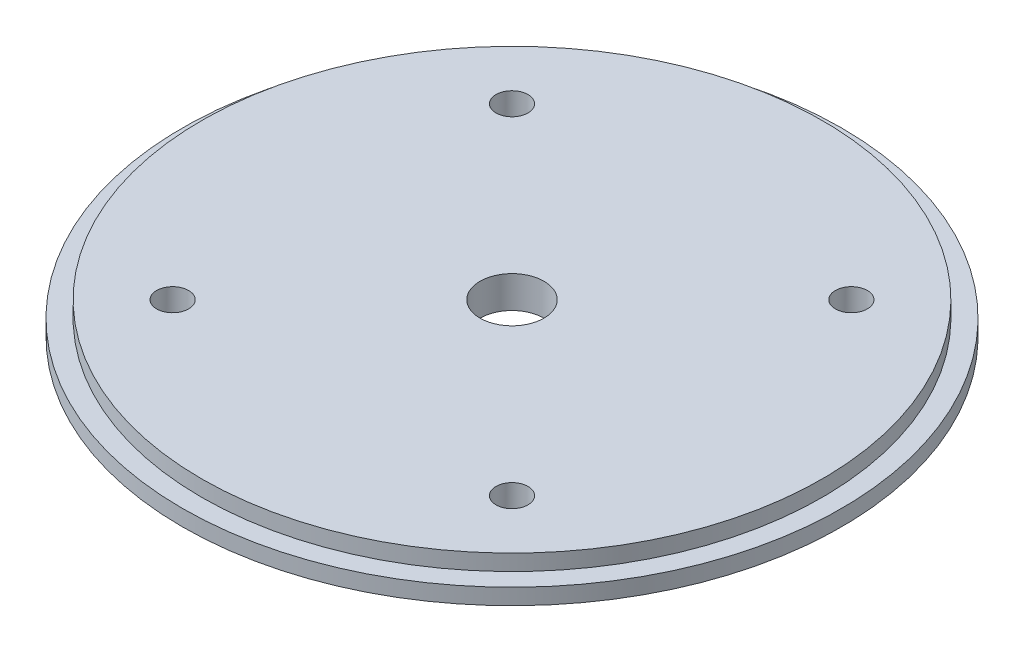
ISO-10303-21;
HEADER;
FILE_DESCRIPTION(('STEP AP214'),'2;1');
FILE_NAME('part.step','',(''),(''),'','','');
FILE_SCHEMA(('AUTOMOTIVE_DESIGN { 1 0 10303 214 1 1 1 1 }'));
ENDSEC;
DATA;
#1=APPLICATION_CONTEXT('core data for automotive mechanical design processes');
#2=APPLICATION_PROTOCOL_DEFINITION('international standard','automotive_design',2000,#1);
#3=PRODUCT_CONTEXT('',#1,'mechanical');
#4=PRODUCT('Part','Part','',(#3));
#5=PRODUCT_RELATED_PRODUCT_CATEGORY('part','',(#4));
#6=PRODUCT_DEFINITION_FORMATION('','',#4);
#7=PRODUCT_DEFINITION_CONTEXT('part definition',#1,'design');
#8=PRODUCT_DEFINITION('design','',#6,#7);
#9=PRODUCT_DEFINITION_SHAPE('','',#8);
#10=(LENGTH_UNIT() NAMED_UNIT(*) SI_UNIT(.MILLI.,.METRE.));
#11=(NAMED_UNIT(*) PLANE_ANGLE_UNIT() SI_UNIT($,.RADIAN.));
#12=(NAMED_UNIT(*) SI_UNIT($,.STERADIAN.) SOLID_ANGLE_UNIT());
#13=UNCERTAINTY_MEASURE_WITH_UNIT(LENGTH_MEASURE(1.E-05),#10,'distance_accuracy_value','');
#14=(GEOMETRIC_REPRESENTATION_CONTEXT(3) GLOBAL_UNCERTAINTY_ASSIGNED_CONTEXT((#13)) GLOBAL_UNIT_ASSIGNED_CONTEXT((#10,
#11,#12)) REPRESENTATION_CONTEXT('',''));
#15=CARTESIAN_POINT('',(0.,0.,0.));
#16=DIRECTION('',(0.,0.,1.));
#17=DIRECTION('',(1.,0.,0.));
#18=AXIS2_PLACEMENT_3D('',#15,#16,#17);
#19=CARTESIAN_POINT('',(-33.6759604540092,6.35,-33.6759604540095));
#20=DIRECTION('',(0.,1.,0.));
#21=DIRECTION('',(0.,0.,1.));
#22=AXIS2_PLACEMENT_3D('',#19,#20,#21);
#23=CYLINDRICAL_SURFACE('',#22,3.175);
#24=CARTESIAN_POINT('',(-33.6759604540092,6.35,-33.6759604540095));
#25=DIRECTION('',(0.,1.,0.));
#26=DIRECTION('',(0.,0.,1.));
#27=AXIS2_PLACEMENT_3D('',#24,#25,#26);
#28=CIRCLE('',#27,3.175);
#29=CARTESIAN_POINT('',(-33.6759604540092,6.35,-30.5009604540095));
#30=VERTEX_POINT('',#29);
#31=EDGE_CURVE('E88',#30,#30,#28,.T.);
#32=ORIENTED_EDGE('',*,*,#31,.T.);
#33=EDGE_LOOP('',(#32));
#34=FACE_BOUND('',#33,.T.);
#35=CARTESIAN_POINT('',(-33.6759604540092,1.5875,-33.6759604540095));
#36=DIRECTION('',(0.,-1.,0.));
#37=DIRECTION('',(0.,0.,-1.));
#38=AXIS2_PLACEMENT_3D('',#35,#36,#37);
#39=CIRCLE('',#38,3.175);
#40=CARTESIAN_POINT('',(-33.6759604540092,1.5875,-36.8509604540095));
#41=VERTEX_POINT('',#40);
#42=EDGE_CURVE('E41',#41,#41,#39,.F.);
#43=ORIENTED_EDGE('',*,*,#42,.F.);
#44=EDGE_LOOP('',(#43));
#45=FACE_BOUND('',#44,.T.);
#46=ADVANCED_FACE('F37',(#34,#45),#23,.F.);
#47=CARTESIAN_POINT('',(33.6759604540092,6.35,33.6759604540095));
#48=DIRECTION('',(0.,1.,0.));
#49=DIRECTION('',(0.,0.,1.));
#50=AXIS2_PLACEMENT_3D('',#47,#48,#49);
#51=CYLINDRICAL_SURFACE('',#50,3.175);
#52=CARTESIAN_POINT('',(33.6759604540092,6.35,33.6759604540095));
#53=DIRECTION('',(0.,1.,0.));
#54=DIRECTION('',(0.,0.,1.));
#55=AXIS2_PLACEMENT_3D('',#52,#53,#54);
#56=CIRCLE('',#55,3.175);
#57=CARTESIAN_POINT('',(33.6759604540092,6.35,36.8509604540095));
#58=VERTEX_POINT('',#57);
#59=EDGE_CURVE('E85',#58,#58,#56,.T.);
#60=ORIENTED_EDGE('',*,*,#59,.T.);
#61=EDGE_LOOP('',(#60));
#62=FACE_BOUND('',#61,.T.);
#63=CARTESIAN_POINT('',(33.6759604540092,1.5875,33.6759604540095));
#64=DIRECTION('',(0.,-1.,0.));
#65=DIRECTION('',(0.,0.,-1.));
#66=AXIS2_PLACEMENT_3D('',#63,#64,#65);
#67=CIRCLE('',#66,3.175);
#68=CARTESIAN_POINT('',(33.6759604540092,1.5875,30.5009604540095));
#69=VERTEX_POINT('',#68);
#70=EDGE_CURVE('E60',#69,#69,#67,.F.);
#71=ORIENTED_EDGE('',*,*,#70,.F.);
#72=EDGE_LOOP('',(#71));
#73=FACE_BOUND('',#72,.T.);
#74=ADVANCED_FACE('F115',(#62,#73),#51,.F.);
#75=CARTESIAN_POINT('',(33.6759604540095,6.35,-33.6759604540092));
#76=DIRECTION('',(0.,1.,0.));
#77=DIRECTION('',(0.,0.,1.));
#78=AXIS2_PLACEMENT_3D('',#75,#76,#77);
#79=CYLINDRICAL_SURFACE('',#78,3.175);
#80=CARTESIAN_POINT('',(33.6759604540095,6.35,-33.6759604540092));
#81=DIRECTION('',(0.,1.,0.));
#82=DIRECTION('',(0.,0.,1.));
#83=AXIS2_PLACEMENT_3D('',#80,#81,#82);
#84=CIRCLE('',#83,3.175);
#85=CARTESIAN_POINT('',(33.6759604540095,6.35,-30.5009604540092));
#86=VERTEX_POINT('',#85);
#87=EDGE_CURVE('E82',#86,#86,#84,.T.);
#88=ORIENTED_EDGE('',*,*,#87,.T.);
#89=EDGE_LOOP('',(#88));
#90=FACE_BOUND('',#89,.T.);
#91=CARTESIAN_POINT('',(33.6759604540095,1.5875,-33.6759604540092));
#92=DIRECTION('',(0.,-1.,0.));
#93=DIRECTION('',(0.,0.,-1.));
#94=AXIS2_PLACEMENT_3D('',#91,#92,#93);
#95=CIRCLE('',#94,3.175);
#96=CARTESIAN_POINT('',(33.6759604540095,1.5875,-36.8509604540092));
#97=VERTEX_POINT('',#96);
#98=EDGE_CURVE('E57',#97,#97,#95,.F.);
#99=ORIENTED_EDGE('',*,*,#98,.F.);
#100=EDGE_LOOP('',(#99));
#101=FACE_BOUND('',#100,.T.);
#102=ADVANCED_FACE('F121',(#90,#101),#79,.F.);
#103=CARTESIAN_POINT('',(-33.6759604540095,6.35,33.6759604540092));
#104=DIRECTION('',(0.,1.,0.));
#105=DIRECTION('',(0.,0.,1.));
#106=AXIS2_PLACEMENT_3D('',#103,#104,#105);
#107=CYLINDRICAL_SURFACE('',#106,3.175);
#108=CARTESIAN_POINT('',(-33.6759604540095,6.35,33.6759604540092));
#109=DIRECTION('',(0.,1.,0.));
#110=DIRECTION('',(0.,0.,1.));
#111=AXIS2_PLACEMENT_3D('',#108,#109,#110);
#112=CIRCLE('',#111,3.175);
#113=CARTESIAN_POINT('',(-33.6759604540095,6.35,36.8509604540092));
#114=VERTEX_POINT('',#113);
#115=EDGE_CURVE('E74',#114,#114,#112,.T.);
#116=ORIENTED_EDGE('',*,*,#115,.T.);
#117=EDGE_LOOP('',(#116));
#118=FACE_BOUND('',#117,.T.);
#119=CARTESIAN_POINT('',(-33.6759604540095,1.5875,33.6759604540092));
#120=DIRECTION('',(0.,-1.,0.));
#121=DIRECTION('',(0.,0.,-1.));
#122=AXIS2_PLACEMENT_3D('',#119,#120,#121);
#123=CIRCLE('',#122,3.175);
#124=CARTESIAN_POINT('',(-33.6759604540095,1.5875,30.5009604540092));
#125=VERTEX_POINT('',#124);
#126=EDGE_CURVE('E54',#125,#125,#123,.F.);
#127=ORIENTED_EDGE('',*,*,#126,.F.);
#128=EDGE_LOOP('',(#127));
#129=FACE_BOUND('',#128,.T.);
#130=ADVANCED_FACE('F128',(#118,#129),#107,.F.);
#131=CARTESIAN_POINT('',(0.,6.35,0.));
#132=DIRECTION('',(0.,-1.,0.));
#133=DIRECTION('',(0.,0.,-1.));
#134=AXIS2_PLACEMENT_3D('',#131,#132,#133);
#135=CYLINDRICAL_SURFACE('',#134,65.405);
#136=CARTESIAN_POINT('',(0.,0.,0.));
#137=DIRECTION('',(0.,1.,0.));
#138=DIRECTION('',(0.,0.,1.));
#139=AXIS2_PLACEMENT_3D('',#136,#137,#138);
#140=CIRCLE('',#139,65.405);
#141=CARTESIAN_POINT('',(0.,0.,65.405));
#142=VERTEX_POINT('',#141);
#143=EDGE_CURVE('E10',#142,#142,#140,.T.);
#144=ORIENTED_EDGE('',*,*,#143,.T.);
#145=EDGE_LOOP('',(#144));
#146=FACE_BOUND('',#145,.T.);
#147=CARTESIAN_POINT('',(0.,3.175,0.));
#148=DIRECTION('',(0.,1.,0.));
#149=DIRECTION('',(0.,0.,1.));
#150=AXIS2_PLACEMENT_3D('',#147,#148,#149);
#151=CIRCLE('',#150,65.405);
#152=CARTESIAN_POINT('',(0.,3.175,65.405));
#153=VERTEX_POINT('',#152);
#154=EDGE_CURVE('E45',#153,#153,#151,.T.);
#155=ORIENTED_EDGE('',*,*,#154,.F.);
#156=EDGE_LOOP('',(#155));
#157=FACE_BOUND('',#156,.T.);
#158=ADVANCED_FACE('F39',(#146,#157),#135,.T.);
#159=CARTESIAN_POINT('',(0.,0.,0.));
#160=DIRECTION('',(0.,1.,0.));
#161=DIRECTION('',(0.,0.,1.));
#162=AXIS2_PLACEMENT_3D('',#159,#160,#161);
#163=PLANE('',#162);
#164=CARTESIAN_POINT('',(-33.6759604540092,0.,-33.6759604540095));
#165=DIRECTION('',(0.,-1.,0.));
#166=DIRECTION('',(0.,0.,-1.));
#167=AXIS2_PLACEMENT_3D('',#164,#165,#166);
#168=CIRCLE('',#167,6.0325);
#169=CARTESIAN_POINT('',(-33.6759604540092,0.,-39.7084604540095));
#170=VERTEX_POINT('',#169);
#171=EDGE_CURVE('E186',#170,#170,#168,.T.);
#172=ORIENTED_EDGE('',*,*,#171,.F.);
#173=EDGE_LOOP('',(#172));
#174=FACE_BOUND('',#173,.T.);
#175=CARTESIAN_POINT('',(33.6759604540095,0.,-33.6759604540092));
#176=DIRECTION('',(0.,-1.,0.));
#177=DIRECTION('',(0.,0.,-1.));
#178=AXIS2_PLACEMENT_3D('',#175,#176,#177);
#179=CIRCLE('',#178,6.0325);
#180=CARTESIAN_POINT('',(33.6759604540095,0.,-39.7084604540092));
#181=VERTEX_POINT('',#180);
#182=EDGE_CURVE('E178',#181,#181,#179,.T.);
#183=ORIENTED_EDGE('',*,*,#182,.F.);
#184=EDGE_LOOP('',(#183));
#185=FACE_BOUND('',#184,.T.);
#186=CARTESIAN_POINT('',(33.6759604540092,0.,33.6759604540095));
#187=DIRECTION('',(0.,-1.,0.));
#188=DIRECTION('',(0.,0.,-1.));
#189=AXIS2_PLACEMENT_3D('',#186,#187,#188);
#190=CIRCLE('',#189,6.0325);
#191=CARTESIAN_POINT('',(33.6759604540092,0.,27.6434604540095));
#192=VERTEX_POINT('',#191);
#193=EDGE_CURVE('E174',#192,#192,#190,.T.);
#194=ORIENTED_EDGE('',*,*,#193,.F.);
#195=EDGE_LOOP('',(#194));
#196=FACE_BOUND('',#195,.T.);
#197=CARTESIAN_POINT('',(-33.6759604540095,0.,33.6759604540092));
#198=DIRECTION('',(0.,-1.,0.));
#199=DIRECTION('',(0.,0.,-1.));
#200=AXIS2_PLACEMENT_3D('',#197,#198,#199);
#201=CIRCLE('',#200,6.0325);
#202=CARTESIAN_POINT('',(-33.6759604540095,0.,27.6434604540092));
#203=VERTEX_POINT('',#202);
#204=EDGE_CURVE('E77',#203,#203,#201,.T.);
#205=ORIENTED_EDGE('',*,*,#204,.F.);
#206=EDGE_LOOP('',(#205));
#207=FACE_BOUND('',#206,.T.);
#208=CARTESIAN_POINT('',(0.,0.,0.));
#209=DIRECTION('',(0.,1.,0.));
#210=DIRECTION('',(0.,0.,1.));
#211=AXIS2_PLACEMENT_3D('',#208,#209,#210);
#212=CIRCLE('',#211,6.35);
#213=CARTESIAN_POINT('',(0.,0.,6.35));
#214=VERTEX_POINT('',#213);
#215=EDGE_CURVE('E69',#214,#214,#212,.T.);
#216=ORIENTED_EDGE('',*,*,#215,.T.);
#217=EDGE_LOOP('',(#216));
#218=FACE_BOUND('',#217,.T.);
#219=ORIENTED_EDGE('',*,*,#143,.F.);
#220=EDGE_LOOP('',(#219));
#221=FACE_BOUND('',#220,.T.);
#222=ADVANCED_FACE('F110',(#174,#185,#196,#207,#218,#221),#163,.F.);
#223=CARTESIAN_POINT('',(0.,3.175,0.));
#224=DIRECTION('',(0.,1.,0.));
#225=DIRECTION('',(0.,0.,1.));
#226=AXIS2_PLACEMENT_3D('',#223,#224,#225);
#227=PLANE('',#226);
#228=CARTESIAN_POINT('',(0.,3.175,0.));
#229=DIRECTION('',(0.,1.,0.));
#230=DIRECTION('',(0.,0.,1.));
#231=AXIS2_PLACEMENT_3D('',#228,#229,#230);
#232=CIRCLE('',#231,61.595);
#233=CARTESIAN_POINT('',(0.,3.175,61.595));
#234=VERTEX_POINT('',#233);
#235=EDGE_CURVE('E50',#234,#234,#232,.T.);
#236=ORIENTED_EDGE('',*,*,#235,.F.);
#237=EDGE_LOOP('',(#236));
#238=FACE_BOUND('',#237,.T.);
#239=ORIENTED_EDGE('',*,*,#154,.T.);
#240=EDGE_LOOP('',(#239));
#241=FACE_BOUND('',#240,.T.);
#242=ADVANCED_FACE('F100',(#238,#241),#227,.T.);
#243=CARTESIAN_POINT('',(0.,3.175,0.));
#244=DIRECTION('',(0.,1.,0.));
#245=DIRECTION('',(0.,0.,1.));
#246=AXIS2_PLACEMENT_3D('',#243,#244,#245);
#247=CYLINDRICAL_SURFACE('',#246,61.595);
#248=ORIENTED_EDGE('',*,*,#235,.T.);
#249=EDGE_LOOP('',(#248));
#250=FACE_BOUND('',#249,.T.);
#251=CARTESIAN_POINT('',(0.,6.35,0.));
#252=DIRECTION('',(0.,1.,0.));
#253=DIRECTION('',(0.,0.,1.));
#254=AXIS2_PLACEMENT_3D('',#251,#252,#253);
#255=CIRCLE('',#254,61.595);
#256=CARTESIAN_POINT('',(0.,6.35,61.595));
#257=VERTEX_POINT('',#256);
#258=EDGE_CURVE('E91',#257,#257,#255,.T.);
#259=ORIENTED_EDGE('',*,*,#258,.F.);
#260=EDGE_LOOP('',(#259));
#261=FACE_BOUND('',#260,.T.);
#262=ADVANCED_FACE('F98',(#250,#261),#247,.T.);
#263=CARTESIAN_POINT('',(0.,6.35,0.));
#264=DIRECTION('',(0.,1.,0.));
#265=DIRECTION('',(0.,0.,1.));
#266=AXIS2_PLACEMENT_3D('',#263,#264,#265);
#267=PLANE('',#266);
#268=CARTESIAN_POINT('',(0.,6.35,0.));
#269=DIRECTION('',(0.,1.,0.));
#270=DIRECTION('',(0.,0.,1.));
#271=AXIS2_PLACEMENT_3D('',#268,#269,#270);
#272=CIRCLE('',#271,6.35);
#273=CARTESIAN_POINT('',(0.,6.35,6.35));
#274=VERTEX_POINT('',#273);
#275=EDGE_CURVE('E65',#274,#274,#272,.T.);
#276=ORIENTED_EDGE('',*,*,#275,.F.);
#277=EDGE_LOOP('',(#276));
#278=FACE_BOUND('',#277,.T.);
#279=ORIENTED_EDGE('',*,*,#115,.F.);
#280=EDGE_LOOP('',(#279));
#281=FACE_BOUND('',#280,.T.);
#282=ORIENTED_EDGE('',*,*,#87,.F.);
#283=EDGE_LOOP('',(#282));
#284=FACE_BOUND('',#283,.T.);
#285=ORIENTED_EDGE('',*,*,#59,.F.);
#286=EDGE_LOOP('',(#285));
#287=FACE_BOUND('',#286,.T.);
#288=ORIENTED_EDGE('',*,*,#31,.F.);
#289=EDGE_LOOP('',(#288));
#290=FACE_BOUND('',#289,.T.);
#291=ORIENTED_EDGE('',*,*,#258,.T.);
#292=EDGE_LOOP('',(#291));
#293=FACE_BOUND('',#292,.T.);
#294=ADVANCED_FACE('F96',(#278,#281,#284,#287,#290,#293),#267,.T.);
#295=CARTESIAN_POINT('',(0.,6.35,0.));
#296=DIRECTION('',(0.,1.,0.));
#297=DIRECTION('',(0.,0.,1.));
#298=AXIS2_PLACEMENT_3D('',#295,#296,#297);
#299=CYLINDRICAL_SURFACE('',#298,6.35);
#300=ORIENTED_EDGE('',*,*,#215,.F.);
#301=EDGE_LOOP('',(#300));
#302=FACE_BOUND('',#301,.T.);
#303=ORIENTED_EDGE('',*,*,#275,.T.);
#304=EDGE_LOOP('',(#303));
#305=FACE_BOUND('',#304,.T.);
#306=ADVANCED_FACE('F107',(#302,#305),#299,.F.);
#307=CARTESIAN_POINT('',(-33.6759604540095,1.5875,33.6759604540092));
#308=DIRECTION('',(0.,-1.,0.));
#309=DIRECTION('',(0.,0.,-1.));
#310=AXIS2_PLACEMENT_3D('',#307,#308,#309);
#311=PLANE('',#310);
#312=CARTESIAN_POINT('',(-33.6759604540095,1.5875,33.6759604540092));
#313=DIRECTION('',(0.,-1.,0.));
#314=DIRECTION('',(0.,0.,-1.));
#315=AXIS2_PLACEMENT_3D('',#312,#313,#314);
#316=CIRCLE('',#315,6.0325);
#317=CARTESIAN_POINT('',(-33.6759604540095,1.5875,27.6434604540092));
#318=VERTEX_POINT('',#317);
#319=EDGE_CURVE('E58',#318,#318,#316,.T.);
#320=ORIENTED_EDGE('',*,*,#319,.T.);
#321=EDGE_LOOP('',(#320));
#322=FACE_BOUND('',#321,.T.);
#323=ORIENTED_EDGE('',*,*,#126,.T.);
#324=EDGE_LOOP('',(#323));
#325=FACE_BOUND('',#324,.T.);
#326=ADVANCED_FACE('F134',(#322,#325),#311,.T.);
#327=CARTESIAN_POINT('',(-33.6759604540095,1.5875,33.6759604540092));
#328=DIRECTION('',(0.,-1.,0.));
#329=DIRECTION('',(0.,0.,-1.));
#330=AXIS2_PLACEMENT_3D('',#327,#328,#329);
#331=CYLINDRICAL_SURFACE('',#330,6.0325);
#332=ORIENTED_EDGE('',*,*,#319,.F.);
#333=EDGE_LOOP('',(#332));
#334=FACE_BOUND('',#333,.T.);
#335=ORIENTED_EDGE('',*,*,#204,.T.);
#336=EDGE_LOOP('',(#335));
#337=FACE_BOUND('',#336,.T.);
#338=ADVANCED_FACE('F136',(#334,#337),#331,.F.);
#339=CARTESIAN_POINT('',(33.6759604540095,1.5875,-33.6759604540092));
#340=DIRECTION('',(0.,-1.,0.));
#341=DIRECTION('',(0.,0.,-1.));
#342=AXIS2_PLACEMENT_3D('',#339,#340,#341);
#343=PLANE('',#342);
#344=CARTESIAN_POINT('',(33.6759604540095,1.5875,-33.6759604540092));
#345=DIRECTION('',(0.,-1.,0.));
#346=DIRECTION('',(0.,0.,-1.));
#347=AXIS2_PLACEMENT_3D('',#344,#345,#346);
#348=CIRCLE('',#347,6.0325);
#349=CARTESIAN_POINT('',(33.6759604540095,1.5875,-39.7084604540092));
#350=VERTEX_POINT('',#349);
#351=EDGE_CURVE('E183',#350,#350,#348,.T.);
#352=ORIENTED_EDGE('',*,*,#351,.T.);
#353=EDGE_LOOP('',(#352));
#354=FACE_BOUND('',#353,.T.);
#355=ORIENTED_EDGE('',*,*,#98,.T.);
#356=EDGE_LOOP('',(#355));
#357=FACE_BOUND('',#356,.T.);
#358=ADVANCED_FACE('F139',(#354,#357),#343,.T.);
#359=CARTESIAN_POINT('',(33.6759604540095,1.5875,-33.6759604540092));
#360=DIRECTION('',(0.,-1.,0.));
#361=DIRECTION('',(0.,0.,-1.));
#362=AXIS2_PLACEMENT_3D('',#359,#360,#361);
#363=CYLINDRICAL_SURFACE('',#362,6.0325);
#364=ORIENTED_EDGE('',*,*,#351,.F.);
#365=EDGE_LOOP('',(#364));
#366=FACE_BOUND('',#365,.T.);
#367=ORIENTED_EDGE('',*,*,#182,.T.);
#368=EDGE_LOOP('',(#367));
#369=FACE_BOUND('',#368,.T.);
#370=ADVANCED_FACE('F155',(#366,#369),#363,.F.);
#371=CARTESIAN_POINT('',(33.6759604540092,1.5875,33.6759604540095));
#372=DIRECTION('',(0.,-1.,0.));
#373=DIRECTION('',(0.,0.,-1.));
#374=AXIS2_PLACEMENT_3D('',#371,#372,#373);
#375=PLANE('',#374);
#376=CARTESIAN_POINT('',(33.6759604540092,1.5875,33.6759604540095));
#377=DIRECTION('',(0.,-1.,0.));
#378=DIRECTION('',(0.,0.,-1.));
#379=AXIS2_PLACEMENT_3D('',#376,#377,#378);
#380=CIRCLE('',#379,6.0325);
#381=CARTESIAN_POINT('',(33.6759604540092,1.5875,27.6434604540095));
#382=VERTEX_POINT('',#381);
#383=EDGE_CURVE('E171',#382,#382,#380,.T.);
#384=ORIENTED_EDGE('',*,*,#383,.T.);
#385=EDGE_LOOP('',(#384));
#386=FACE_BOUND('',#385,.T.);
#387=ORIENTED_EDGE('',*,*,#70,.T.);
#388=EDGE_LOOP('',(#387));
#389=FACE_BOUND('',#388,.T.);
#390=ADVANCED_FACE('F159',(#386,#389),#375,.T.);
#391=CARTESIAN_POINT('',(33.6759604540092,1.5875,33.6759604540095));
#392=DIRECTION('',(0.,-1.,0.));
#393=DIRECTION('',(0.,0.,-1.));
#394=AXIS2_PLACEMENT_3D('',#391,#392,#393);
#395=CYLINDRICAL_SURFACE('',#394,6.0325);
#396=ORIENTED_EDGE('',*,*,#383,.F.);
#397=EDGE_LOOP('',(#396));
#398=FACE_BOUND('',#397,.T.);
#399=ORIENTED_EDGE('',*,*,#193,.T.);
#400=EDGE_LOOP('',(#399));
#401=FACE_BOUND('',#400,.T.);
#402=ADVANCED_FACE('F148',(#398,#401),#395,.F.);
#403=CARTESIAN_POINT('',(-33.6759604540092,1.5875,-33.6759604540095));
#404=DIRECTION('',(0.,-1.,0.));
#405=DIRECTION('',(0.,0.,-1.));
#406=AXIS2_PLACEMENT_3D('',#403,#404,#405);
#407=PLANE('',#406);
#408=CARTESIAN_POINT('',(-33.6759604540092,1.5875,-33.6759604540095));
#409=DIRECTION('',(0.,-1.,0.));
#410=DIRECTION('',(0.,0.,-1.));
#411=AXIS2_PLACEMENT_3D('',#408,#409,#410);
#412=CIRCLE('',#411,6.0325);
#413=CARTESIAN_POINT('',(-33.6759604540092,1.5875,-39.7084604540095));
#414=VERTEX_POINT('',#413);
#415=EDGE_CURVE('E189',#414,#414,#412,.T.);
#416=ORIENTED_EDGE('',*,*,#415,.T.);
#417=EDGE_LOOP('',(#416));
#418=FACE_BOUND('',#417,.T.);
#419=ORIENTED_EDGE('',*,*,#42,.T.);
#420=EDGE_LOOP('',(#419));
#421=FACE_BOUND('',#420,.T.);
#422=ADVANCED_FACE('F144',(#418,#421),#407,.T.);
#423=CARTESIAN_POINT('',(-33.6759604540092,1.5875,-33.6759604540095));
#424=DIRECTION('',(0.,-1.,0.));
#425=DIRECTION('',(0.,0.,-1.));
#426=AXIS2_PLACEMENT_3D('',#423,#424,#425);
#427=CYLINDRICAL_SURFACE('',#426,6.0325);
#428=ORIENTED_EDGE('',*,*,#415,.F.);
#429=EDGE_LOOP('',(#428));
#430=FACE_BOUND('',#429,.T.);
#431=ORIENTED_EDGE('',*,*,#171,.T.);
#432=EDGE_LOOP('',(#431));
#433=FACE_BOUND('',#432,.T.);
#434=ADVANCED_FACE('F147',(#430,#433),#427,.F.);
#435=CLOSED_SHELL('',(#46,#74,#102,#130,#158,#222,#242,#262,#294,#306,#326,#338,#358,#370,#390,
#402,#422,#434));
#436=MANIFOLD_SOLID_BREP('B2',#435);
#437=ADVANCED_BREP_SHAPE_REPRESENTATION('',(#18,#436),#14);
#438=SHAPE_DEFINITION_REPRESENTATION(#9,#437);
ENDSEC;
END-ISO-10303-21;
